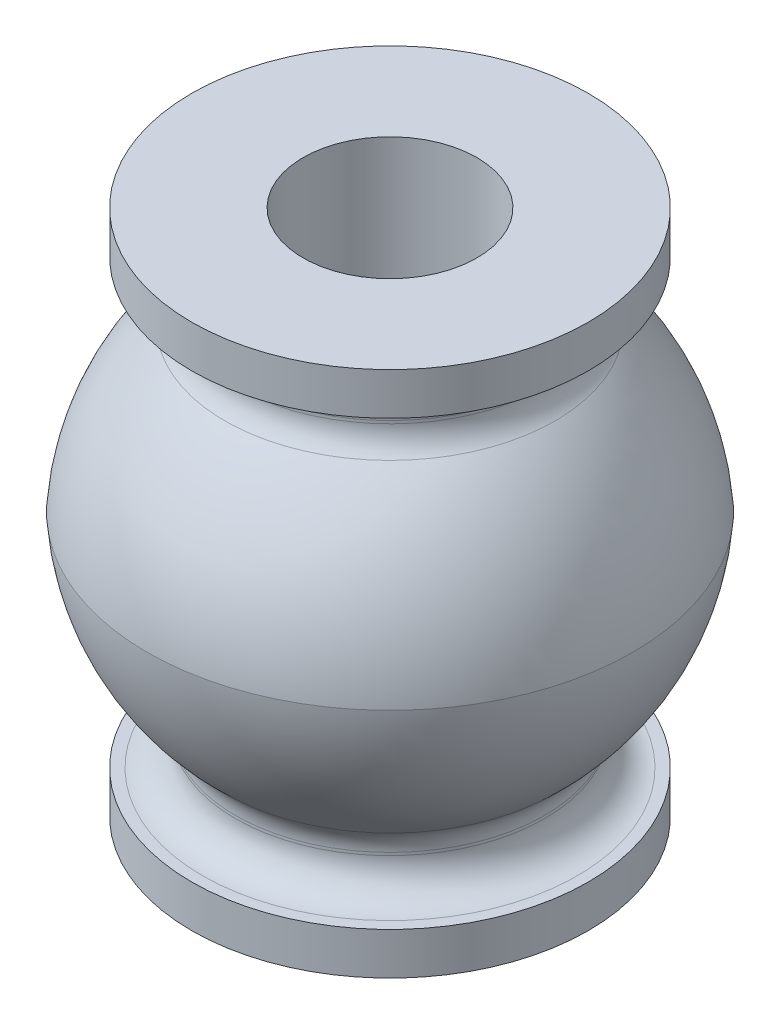
ISO-10303-21;
HEADER;
FILE_DESCRIPTION(('STEP AP214'),'2;1');
FILE_NAME('part.step','',(''),(''),'','','');
FILE_SCHEMA(('AUTOMOTIVE_DESIGN { 1 0 10303 214 1 1 1 1 }'));
ENDSEC;
DATA;
#1=APPLICATION_CONTEXT('core data for automotive mechanical design processes');
#2=APPLICATION_PROTOCOL_DEFINITION('international standard','automotive_design',2000,#1);
#3=PRODUCT_CONTEXT('',#1,'mechanical');
#4=PRODUCT('Part','Part','',(#3));
#5=PRODUCT_RELATED_PRODUCT_CATEGORY('part','',(#4));
#6=PRODUCT_DEFINITION_FORMATION('','',#4);
#7=PRODUCT_DEFINITION_CONTEXT('part definition',#1,'design');
#8=PRODUCT_DEFINITION('design','',#6,#7);
#9=PRODUCT_DEFINITION_SHAPE('','',#8);
#10=(LENGTH_UNIT() NAMED_UNIT(*) SI_UNIT(.MILLI.,.METRE.));
#11=(NAMED_UNIT(*) PLANE_ANGLE_UNIT() SI_UNIT($,.RADIAN.));
#12=(NAMED_UNIT(*) SI_UNIT($,.STERADIAN.) SOLID_ANGLE_UNIT());
#13=UNCERTAINTY_MEASURE_WITH_UNIT(LENGTH_MEASURE(1.E-05),#10,'distance_accuracy_value','');
#14=(GEOMETRIC_REPRESENTATION_CONTEXT(3) GLOBAL_UNCERTAINTY_ASSIGNED_CONTEXT((#13)) GLOBAL_UNIT_ASSIGNED_CONTEXT((#10,
#11,#12)) REPRESENTATION_CONTEXT('',''));
#15=CARTESIAN_POINT('',(0.,0.,0.));
#16=DIRECTION('',(0.,0.,1.));
#17=DIRECTION('',(1.,0.,0.));
#18=AXIS2_PLACEMENT_3D('',#15,#16,#17);
#19=CARTESIAN_POINT('',(6.02,6.72,0.));
#20=DIRECTION('',(0.,-1.,0.));
#21=DIRECTION('',(0.,0.,-1.));
#22=AXIS2_PLACEMENT_3D('',#19,#20,#21);
#23=PLANE('',#22);
#24=CARTESIAN_POINT('',(0.,6.72,0.));
#25=DIRECTION('',(0.,-1.,0.));
#26=DIRECTION('',(0.,0.,-1.));
#27=AXIS2_PLACEMENT_3D('',#24,#25,#26);
#28=CIRCLE('',#27,5.69);
#29=CARTESIAN_POINT('',(0.,6.72,-5.69));
#30=VERTEX_POINT('',#29);
#31=EDGE_CURVE('E10',#30,#30,#28,.F.);
#32=ORIENTED_EDGE('',*,*,#31,.T.);
#33=EDGE_LOOP('',(#32));
#34=FACE_BOUND('',#33,.T.);
#35=CARTESIAN_POINT('',(0.,6.72,0.));
#36=DIRECTION('',(0.,-1.,0.));
#37=DIRECTION('',(0.,0.,-1.));
#38=AXIS2_PLACEMENT_3D('',#35,#36,#37);
#39=CIRCLE('',#38,6.02);
#40=CARTESIAN_POINT('',(0.,6.72,-6.02));
#41=VERTEX_POINT('',#40);
#42=EDGE_CURVE('E96',#41,#41,#39,.T.);
#43=ORIENTED_EDGE('',*,*,#42,.T.);
#44=EDGE_LOOP('',(#43));
#45=FACE_BOUND('',#44,.T.);
#46=ADVANCED_FACE('F31',(#34,#45),#23,.T.);
#47=CARTESIAN_POINT('',(0.,-8.,0.));
#48=DIRECTION('',(0.,-1.,0.));
#49=DIRECTION('',(0.,0.,-1.));
#50=AXIS2_PLACEMENT_3D('',#47,#48,#49);
#51=CYLINDRICAL_SURFACE('',#50,4.69);
#52=CARTESIAN_POINT('',(0.,5.63479876645511,0.));
#53=DIRECTION('',(0.,-1.,0.));
#54=DIRECTION('',(0.,0.,-1.));
#55=AXIS2_PLACEMENT_3D('',#52,#53,#54);
#56=CIRCLE('',#55,4.69);
#57=CARTESIAN_POINT('',(0.,5.63479876645511,-4.69));
#58=VERTEX_POINT('',#57);
#59=EDGE_CURVE('E38',#58,#58,#56,.F.);
#60=ORIENTED_EDGE('',*,*,#59,.T.);
#61=EDGE_LOOP('',(#60));
#62=FACE_BOUND('',#61,.T.);
#63=CARTESIAN_POINT('',(0.,5.72,0.));
#64=DIRECTION('',(0.,-1.,0.));
#65=DIRECTION('',(0.,0.,-1.));
#66=AXIS2_PLACEMENT_3D('',#63,#64,#65);
#67=CIRCLE('',#66,4.69);
#68=CARTESIAN_POINT('',(0.,5.72,-4.69));
#69=VERTEX_POINT('',#68);
#70=EDGE_CURVE('E42',#69,#69,#67,.T.);
#71=ORIENTED_EDGE('',*,*,#70,.T.);
#72=EDGE_LOOP('',(#71));
#73=FACE_BOUND('',#72,.T.);
#74=ADVANCED_FACE('F118',(#62,#73),#51,.T.);
#75=CARTESIAN_POINT('',(0.,-0.539630817041113,0.));
#76=DIRECTION('',(0.,-1.,0.));
#77=DIRECTION('',(0.,0.,-1.));
#78=AXIS2_PLACEMENT_3D('',#75,#76,#77);
#79=DEGENERATE_TOROIDAL_SURFACE('',#78,0.00529800084654759,7.4,.F.);
#80=CARTESIAN_POINT('',(0.,4.8997476255627,0.));
#81=DIRECTION('',(0.,-1.,0.));
#82=DIRECTION('',(0.,0.,-1.));
#83=AXIS2_PLACEMENT_3D('',#80,#81,#82);
#84=CIRCLE('',#83,5.01198833323255);
#85=CARTESIAN_POINT('',(0.,4.8997476255627,-5.01198833323255));
#86=VERTEX_POINT('',#85);
#87=EDGE_CURVE('E46',#86,#86,#84,.T.);
#88=ORIENTED_EDGE('',*,*,#87,.T.);
#89=EDGE_LOOP('',(#88));
#90=FACE_BOUND('',#89,.T.);
#91=CARTESIAN_POINT('',(0.,0.,0.));
#92=DIRECTION('',(0.,-1.,0.));
#93=DIRECTION('',(0.,0.,-1.));
#94=AXIS2_PLACEMENT_3D('',#91,#92,#93);
#95=CIRCLE('',#94,7.375);
#96=CARTESIAN_POINT('',(0.,0.,-7.375));
#97=VERTEX_POINT('',#96);
#98=EDGE_CURVE('E63',#97,#97,#95,.T.);
#99=ORIENTED_EDGE('',*,*,#98,.F.);
#100=EDGE_LOOP('',(#99));
#101=FACE_BOUND('',#100,.T.);
#102=ADVANCED_FACE('F123',(#90,#101),#79,.F.);
#103=CARTESIAN_POINT('',(0.,0.539630817041113,0.));
#104=DIRECTION('',(0.,-1.,0.));
#105=DIRECTION('',(0.,0.,-1.));
#106=AXIS2_PLACEMENT_3D('',#103,#104,#105);
#107=DEGENERATE_TOROIDAL_SURFACE('',#106,0.00529800084654759,7.4,.F.);
#108=CARTESIAN_POINT('',(0.,-4.8997476255627,0.));
#109=DIRECTION('',(0.,1.,0.));
#110=DIRECTION('',(0.,0.,1.));
#111=AXIS2_PLACEMENT_3D('',#108,#109,#110);
#112=CIRCLE('',#111,5.01198833323256);
#113=CARTESIAN_POINT('',(0.,-4.8997476255627,5.01198833323256));
#114=VERTEX_POINT('',#113);
#115=EDGE_CURVE('E51',#114,#114,#112,.T.);
#116=ORIENTED_EDGE('',*,*,#115,.T.);
#117=EDGE_LOOP('',(#116));
#118=FACE_BOUND('',#117,.T.);
#119=ORIENTED_EDGE('',*,*,#98,.T.);
#120=EDGE_LOOP('',(#119));
#121=FACE_BOUND('',#120,.T.);
#122=ADVANCED_FACE('F141',(#118,#121),#107,.F.);
#123=CARTESIAN_POINT('',(0.,-8.,0.));
#124=DIRECTION('',(0.,-1.,0.));
#125=DIRECTION('',(0.,0.,-1.));
#126=AXIS2_PLACEMENT_3D('',#123,#124,#125);
#127=CYLINDRICAL_SURFACE('',#126,4.69);
#128=CARTESIAN_POINT('',(0.,-5.72,0.));
#129=DIRECTION('',(0.,1.,0.));
#130=DIRECTION('',(0.,0.,1.));
#131=AXIS2_PLACEMENT_3D('',#128,#129,#130);
#132=CIRCLE('',#131,4.69);
#133=CARTESIAN_POINT('',(0.,-5.72,4.69));
#134=VERTEX_POINT('',#133);
#135=EDGE_CURVE('E54',#134,#134,#132,.T.);
#136=ORIENTED_EDGE('',*,*,#135,.T.);
#137=EDGE_LOOP('',(#136));
#138=FACE_BOUND('',#137,.T.);
#139=CARTESIAN_POINT('',(0.,-5.63479876645511,0.));
#140=DIRECTION('',(0.,-1.,0.));
#141=DIRECTION('',(0.,0.,-1.));
#142=AXIS2_PLACEMENT_3D('',#139,#140,#141);
#143=CIRCLE('',#142,4.69);
#144=CARTESIAN_POINT('',(0.,-5.63479876645511,-4.69));
#145=VERTEX_POINT('',#144);
#146=EDGE_CURVE('E57',#145,#145,#143,.T.);
#147=ORIENTED_EDGE('',*,*,#146,.T.);
#148=EDGE_LOOP('',(#147));
#149=FACE_BOUND('',#148,.T.);
#150=ADVANCED_FACE('F145',(#138,#149),#127,.T.);
#151=CARTESIAN_POINT('',(6.02,-6.72,0.));
#152=DIRECTION('',(0.,1.,0.));
#153=DIRECTION('',(0.,0.,1.));
#154=AXIS2_PLACEMENT_3D('',#151,#152,#153);
#155=PLANE('',#154);
#156=CARTESIAN_POINT('',(0.,-6.72,0.));
#157=DIRECTION('',(0.,1.,0.));
#158=DIRECTION('',(0.,0.,1.));
#159=AXIS2_PLACEMENT_3D('',#156,#157,#158);
#160=CIRCLE('',#159,5.69);
#161=CARTESIAN_POINT('',(0.,-6.72,5.69));
#162=VERTEX_POINT('',#161);
#163=EDGE_CURVE('E60',#162,#162,#160,.F.);
#164=ORIENTED_EDGE('',*,*,#163,.T.);
#165=EDGE_LOOP('',(#164));
#166=FACE_BOUND('',#165,.T.);
#167=CARTESIAN_POINT('',(0.,-6.72,0.));
#168=DIRECTION('',(0.,-1.,0.));
#169=DIRECTION('',(0.,0.,-1.));
#170=AXIS2_PLACEMENT_3D('',#167,#168,#169);
#171=CIRCLE('',#170,6.02);
#172=CARTESIAN_POINT('',(0.,-6.72,-6.02));
#173=VERTEX_POINT('',#172);
#174=EDGE_CURVE('E66',#173,#173,#171,.T.);
#175=ORIENTED_EDGE('',*,*,#174,.F.);
#176=EDGE_LOOP('',(#175));
#177=FACE_BOUND('',#176,.T.);
#178=ADVANCED_FACE('F151',(#166,#177),#155,.T.);
#179=CARTESIAN_POINT('',(0.,-8.,0.));
#180=DIRECTION('',(0.,-1.,0.));
#181=DIRECTION('',(0.,0.,-1.));
#182=AXIS2_PLACEMENT_3D('',#179,#180,#181);
#183=CYLINDRICAL_SURFACE('',#182,6.02);
#184=ORIENTED_EDGE('',*,*,#174,.T.);
#185=EDGE_LOOP('',(#184));
#186=FACE_BOUND('',#185,.T.);
#187=CARTESIAN_POINT('',(0.,-8.,0.));
#188=DIRECTION('',(0.,-1.,0.));
#189=DIRECTION('',(0.,0.,-1.));
#190=AXIS2_PLACEMENT_3D('',#187,#188,#189);
#191=CIRCLE('',#190,6.02);
#192=CARTESIAN_POINT('',(0.,-8.,-6.02));
#193=VERTEX_POINT('',#192);
#194=EDGE_CURVE('E69',#193,#193,#191,.T.);
#195=ORIENTED_EDGE('',*,*,#194,.F.);
#196=EDGE_LOOP('',(#195));
#197=FACE_BOUND('',#196,.T.);
#198=ADVANCED_FACE('F157',(#186,#197),#183,.T.);
#199=CARTESIAN_POINT('',(2.64,-8.,0.));
#200=DIRECTION('',(0.,-1.,0.));
#201=DIRECTION('',(0.,0.,-1.));
#202=AXIS2_PLACEMENT_3D('',#199,#200,#201);
#203=PLANE('',#202);
#204=ORIENTED_EDGE('',*,*,#194,.T.);
#205=EDGE_LOOP('',(#204));
#206=FACE_BOUND('',#205,.T.);
#207=CARTESIAN_POINT('',(0.,-8.,0.));
#208=DIRECTION('',(0.,-1.,0.));
#209=DIRECTION('',(0.,0.,-1.));
#210=AXIS2_PLACEMENT_3D('',#207,#208,#209);
#211=CIRCLE('',#210,2.64);
#212=CARTESIAN_POINT('',(0.,-8.,-2.64));
#213=VERTEX_POINT('',#212);
#214=EDGE_CURVE('E72',#213,#213,#211,.T.);
#215=ORIENTED_EDGE('',*,*,#214,.F.);
#216=EDGE_LOOP('',(#215));
#217=FACE_BOUND('',#216,.T.);
#218=ADVANCED_FACE('F161',(#206,#217),#203,.T.);
#219=CARTESIAN_POINT('',(0.,-8.,0.));
#220=DIRECTION('',(0.,-1.,0.));
#221=DIRECTION('',(0.,0.,-1.));
#222=AXIS2_PLACEMENT_3D('',#219,#220,#221);
#223=CYLINDRICAL_SURFACE('',#222,2.64);
#224=ORIENTED_EDGE('',*,*,#214,.T.);
#225=EDGE_LOOP('',(#224));
#226=FACE_BOUND('',#225,.T.);
#227=CARTESIAN_POINT('',(0.,-4.00515691325642,0.));
#228=DIRECTION('',(0.,-1.,0.));
#229=DIRECTION('',(0.,0.,-1.));
#230=AXIS2_PLACEMENT_3D('',#227,#228,#229);
#231=CIRCLE('',#230,2.64);
#232=CARTESIAN_POINT('',(0.,-4.00515691325642,-2.64));
#233=VERTEX_POINT('',#232);
#234=EDGE_CURVE('E75',#233,#233,#231,.T.);
#235=ORIENTED_EDGE('',*,*,#234,.F.);
#236=EDGE_LOOP('',(#235));
#237=FACE_BOUND('',#236,.T.);
#238=ADVANCED_FACE('F165',(#226,#237),#223,.F.);
#239=CARTESIAN_POINT('',(3.72556041063693,-4.00515691325642,0.));
#240=DIRECTION('',(0.,1.,0.));
#241=DIRECTION('',(0.,0.,1.));
#242=AXIS2_PLACEMENT_3D('',#239,#240,#241);
#243=PLANE('',#242);
#244=ORIENTED_EDGE('',*,*,#234,.T.);
#245=EDGE_LOOP('',(#244));
#246=FACE_BOUND('',#245,.T.);
#247=CARTESIAN_POINT('',(0.,-4.00515691325642,0.));
#248=DIRECTION('',(0.,-1.,0.));
#249=DIRECTION('',(0.,0.,-1.));
#250=AXIS2_PLACEMENT_3D('',#247,#248,#249);
#251=CIRCLE('',#250,3.72556041063692);
#252=CARTESIAN_POINT('',(0.,-4.00515691325642,-3.72556041063692));
#253=VERTEX_POINT('',#252);
#254=EDGE_CURVE('E78',#253,#253,#251,.T.);
#255=ORIENTED_EDGE('',*,*,#254,.F.);
#256=EDGE_LOOP('',(#255));
#257=FACE_BOUND('',#256,.T.);
#258=ADVANCED_FACE('F169',(#246,#257),#243,.T.);
#259=CARTESIAN_POINT('',(0.,0.539630817041113,0.));
#260=DIRECTION('',(0.,-1.,0.));
#261=DIRECTION('',(0.,0.,-1.));
#262=AXIS2_PLACEMENT_3D('',#259,#260,#261);
#263=DEGENERATE_TOROIDAL_SURFACE('',#262,0.00529800084654759,5.88,.F.);
#264=ORIENTED_EDGE('',*,*,#254,.T.);
#265=EDGE_LOOP('',(#264));
#266=FACE_BOUND('',#265,.T.);
#267=CARTESIAN_POINT('',(0.,0.,0.));
#268=DIRECTION('',(0.,-1.,0.));
#269=DIRECTION('',(0.,0.,-1.));
#270=AXIS2_PLACEMENT_3D('',#267,#268,#269);
#271=CIRCLE('',#270,5.84988761374327);
#272=CARTESIAN_POINT('',(0.,0.,-5.84988761374327));
#273=VERTEX_POINT('',#272);
#274=EDGE_CURVE('E81',#273,#273,#271,.T.);
#275=ORIENTED_EDGE('',*,*,#274,.F.);
#276=EDGE_LOOP('',(#275));
#277=FACE_BOUND('',#276,.T.);
#278=ADVANCED_FACE('F173',(#266,#277),#263,.T.);
#279=CARTESIAN_POINT('',(0.,-0.539630817041113,0.));
#280=DIRECTION('',(0.,-1.,0.));
#281=DIRECTION('',(0.,0.,-1.));
#282=AXIS2_PLACEMENT_3D('',#279,#280,#281);
#283=DEGENERATE_TOROIDAL_SURFACE('',#282,0.00529800084654759,5.88,.F.);
#284=ORIENTED_EDGE('',*,*,#274,.T.);
#285=EDGE_LOOP('',(#284));
#286=FACE_BOUND('',#285,.T.);
#287=CARTESIAN_POINT('',(0.,4.00515691325642,0.));
#288=DIRECTION('',(0.,-1.,0.));
#289=DIRECTION('',(0.,0.,-1.));
#290=AXIS2_PLACEMENT_3D('',#287,#288,#289);
#291=CIRCLE('',#290,3.72556041063693);
#292=CARTESIAN_POINT('',(0.,4.00515691325642,-3.72556041063693));
#293=VERTEX_POINT('',#292);
#294=EDGE_CURVE('E84',#293,#293,#291,.T.);
#295=ORIENTED_EDGE('',*,*,#294,.F.);
#296=EDGE_LOOP('',(#295));
#297=FACE_BOUND('',#296,.T.);
#298=ADVANCED_FACE('F177',(#286,#297),#283,.T.);
#299=CARTESIAN_POINT('',(3.72556041063693,4.00515691325642,0.));
#300=DIRECTION('',(0.,-1.,0.));
#301=DIRECTION('',(0.,0.,-1.));
#302=AXIS2_PLACEMENT_3D('',#299,#300,#301);
#303=PLANE('',#302);
#304=ORIENTED_EDGE('',*,*,#294,.T.);
#305=EDGE_LOOP('',(#304));
#306=FACE_BOUND('',#305,.T.);
#307=CARTESIAN_POINT('',(0.,4.00515691325642,0.));
#308=DIRECTION('',(0.,-1.,0.));
#309=DIRECTION('',(0.,0.,-1.));
#310=AXIS2_PLACEMENT_3D('',#307,#308,#309);
#311=CIRCLE('',#310,2.64);
#312=CARTESIAN_POINT('',(0.,4.00515691325642,-2.64));
#313=VERTEX_POINT('',#312);
#314=EDGE_CURVE('E87',#313,#313,#311,.T.);
#315=ORIENTED_EDGE('',*,*,#314,.F.);
#316=EDGE_LOOP('',(#315));
#317=FACE_BOUND('',#316,.T.);
#318=ADVANCED_FACE('F181',(#306,#317),#303,.T.);
#319=CARTESIAN_POINT('',(0.,-8.,0.));
#320=DIRECTION('',(0.,-1.,0.));
#321=DIRECTION('',(0.,0.,-1.));
#322=AXIS2_PLACEMENT_3D('',#319,#320,#321);
#323=CYLINDRICAL_SURFACE('',#322,2.64);
#324=ORIENTED_EDGE('',*,*,#314,.T.);
#325=EDGE_LOOP('',(#324));
#326=FACE_BOUND('',#325,.T.);
#327=CARTESIAN_POINT('',(0.,8.,0.));
#328=DIRECTION('',(0.,-1.,0.));
#329=DIRECTION('',(0.,0.,-1.));
#330=AXIS2_PLACEMENT_3D('',#327,#328,#329);
#331=CIRCLE('',#330,2.64);
#332=CARTESIAN_POINT('',(0.,8.,-2.64));
#333=VERTEX_POINT('',#332);
#334=EDGE_CURVE('E90',#333,#333,#331,.T.);
#335=ORIENTED_EDGE('',*,*,#334,.F.);
#336=EDGE_LOOP('',(#335));
#337=FACE_BOUND('',#336,.T.);
#338=ADVANCED_FACE('F114',(#326,#337),#323,.F.);
#339=CARTESIAN_POINT('',(2.64,8.,0.));
#340=DIRECTION('',(0.,1.,0.));
#341=DIRECTION('',(0.,0.,1.));
#342=AXIS2_PLACEMENT_3D('',#339,#340,#341);
#343=PLANE('',#342);
#344=ORIENTED_EDGE('',*,*,#334,.T.);
#345=EDGE_LOOP('',(#344));
#346=FACE_BOUND('',#345,.T.);
#347=CARTESIAN_POINT('',(0.,8.,0.));
#348=DIRECTION('',(0.,-1.,0.));
#349=DIRECTION('',(0.,0.,-1.));
#350=AXIS2_PLACEMENT_3D('',#347,#348,#349);
#351=CIRCLE('',#350,6.02);
#352=CARTESIAN_POINT('',(0.,8.,-6.02));
#353=VERTEX_POINT('',#352);
#354=EDGE_CURVE('E93',#353,#353,#351,.T.);
#355=ORIENTED_EDGE('',*,*,#354,.F.);
#356=EDGE_LOOP('',(#355));
#357=FACE_BOUND('',#356,.T.);
#358=ADVANCED_FACE('F104',(#346,#357),#343,.T.);
#359=CARTESIAN_POINT('',(0.,-8.,0.));
#360=DIRECTION('',(0.,-1.,0.));
#361=DIRECTION('',(0.,0.,-1.));
#362=AXIS2_PLACEMENT_3D('',#359,#360,#361);
#363=CYLINDRICAL_SURFACE('',#362,6.02);
#364=ORIENTED_EDGE('',*,*,#354,.T.);
#365=EDGE_LOOP('',(#364));
#366=FACE_BOUND('',#365,.T.);
#367=ORIENTED_EDGE('',*,*,#42,.F.);
#368=EDGE_LOOP('',(#367));
#369=FACE_BOUND('',#368,.T.);
#370=ADVANCED_FACE('F101',(#366,#369),#363,.T.);
#371=CARTESIAN_POINT('',(0.,-5.72,0.));
#372=DIRECTION('',(0.,1.,0.));
#373=DIRECTION('',(0.,0.,1.));
#374=AXIS2_PLACEMENT_3D('',#371,#372,#373);
#375=TOROIDAL_SURFACE('',#374,5.69,1.);
#376=ORIENTED_EDGE('',*,*,#135,.F.);
#377=EDGE_LOOP('',(#376));
#378=FACE_BOUND('',#377,.T.);
#379=ORIENTED_EDGE('',*,*,#163,.F.);
#380=EDGE_LOOP('',(#379));
#381=FACE_BOUND('',#380,.T.);
#382=ADVANCED_FACE('F103',(#378,#381),#375,.F.);
#383=CARTESIAN_POINT('',(0.,-5.63479876645511,0.));
#384=DIRECTION('',(0.,-1.,0.));
#385=DIRECTION('',(0.,0.,-1.));
#386=AXIS2_PLACEMENT_3D('',#383,#384,#385);
#387=TOROIDAL_SURFACE('',#386,5.69,1.);
#388=ORIENTED_EDGE('',*,*,#115,.F.);
#389=EDGE_LOOP('',(#388));
#390=FACE_BOUND('',#389,.T.);
#391=ORIENTED_EDGE('',*,*,#146,.F.);
#392=EDGE_LOOP('',(#391));
#393=FACE_BOUND('',#392,.T.);
#394=ADVANCED_FACE('F111',(#390,#393),#387,.F.);
#395=CARTESIAN_POINT('',(0.,5.63479876645511,0.));
#396=DIRECTION('',(0.,-1.,0.));
#397=DIRECTION('',(0.,0.,-1.));
#398=AXIS2_PLACEMENT_3D('',#395,#396,#397);
#399=TOROIDAL_SURFACE('',#398,5.69,1.);
#400=ORIENTED_EDGE('',*,*,#59,.F.);
#401=EDGE_LOOP('',(#400));
#402=FACE_BOUND('',#401,.T.);
#403=ORIENTED_EDGE('',*,*,#87,.F.);
#404=EDGE_LOOP('',(#403));
#405=FACE_BOUND('',#404,.T.);
#406=ADVANCED_FACE('F128',(#402,#405),#399,.F.);
#407=CARTESIAN_POINT('',(0.,5.72,0.));
#408=DIRECTION('',(0.,-1.,0.));
#409=DIRECTION('',(0.,0.,-1.));
#410=AXIS2_PLACEMENT_3D('',#407,#408,#409);
#411=TOROIDAL_SURFACE('',#410,5.69,1.);
#412=ORIENTED_EDGE('',*,*,#31,.F.);
#413=EDGE_LOOP('',(#412));
#414=FACE_BOUND('',#413,.T.);
#415=ORIENTED_EDGE('',*,*,#70,.F.);
#416=EDGE_LOOP('',(#415));
#417=FACE_BOUND('',#416,.T.);
#418=ADVANCED_FACE('F33',(#414,#417),#411,.F.);
#419=CLOSED_SHELL('',(#46,#74,#102,#122,#150,#178,#198,#218,#238,#258,#278,#298,#318,#338,#358,
#370,#382,#394,#406,#418));
#420=MANIFOLD_SOLID_BREP('B2',#419);
#421=ADVANCED_BREP_SHAPE_REPRESENTATION('',(#18,#420),#14);
#422=SHAPE_DEFINITION_REPRESENTATION(#9,#421);
ENDSEC;
END-ISO-10303-21;
